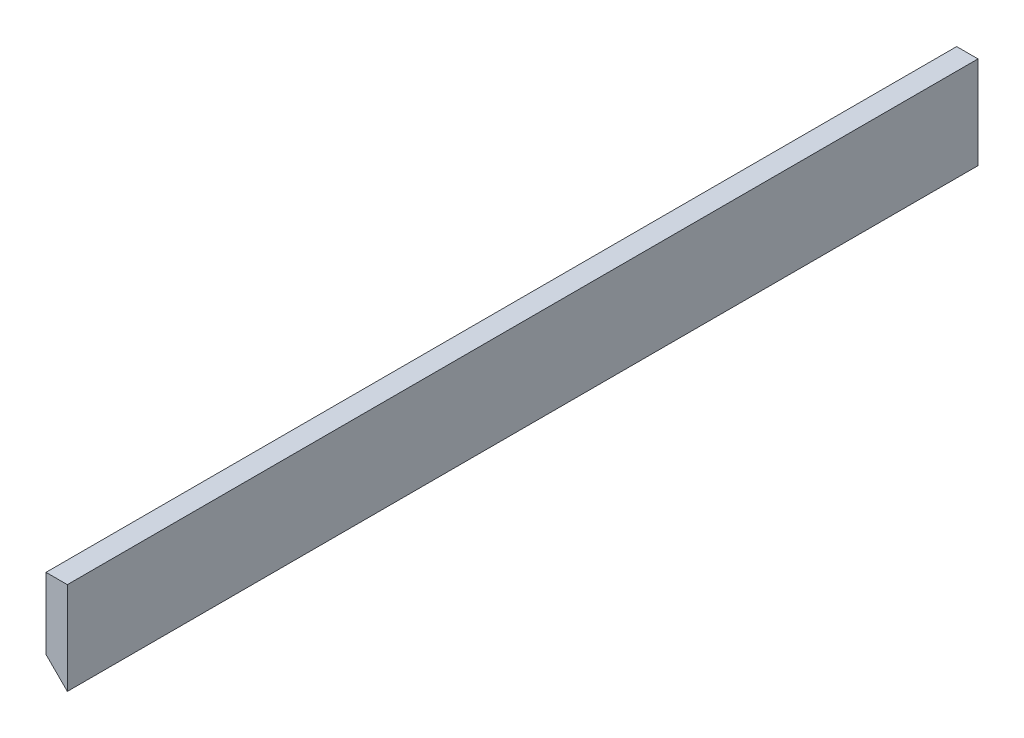
ISO-10303-21;
HEADER;
FILE_DESCRIPTION(('STEP AP214'),'2;1');
FILE_NAME('part.step','',(''),(''),'','','');
FILE_SCHEMA(('AUTOMOTIVE_DESIGN { 1 0 10303 214 1 1 1 1 }'));
ENDSEC;
DATA;
#1=APPLICATION_CONTEXT('core data for automotive mechanical design processes');
#2=APPLICATION_PROTOCOL_DEFINITION('international standard','automotive_design',2000,#1);
#3=PRODUCT_CONTEXT('',#1,'mechanical');
#4=PRODUCT('Part','Part','',(#3));
#5=PRODUCT_RELATED_PRODUCT_CATEGORY('part','',(#4));
#6=PRODUCT_DEFINITION_FORMATION('','',#4);
#7=PRODUCT_DEFINITION_CONTEXT('part definition',#1,'design');
#8=PRODUCT_DEFINITION('design','',#6,#7);
#9=PRODUCT_DEFINITION_SHAPE('','',#8);
#10=(LENGTH_UNIT() NAMED_UNIT(*) SI_UNIT(.MILLI.,.METRE.));
#11=(NAMED_UNIT(*) PLANE_ANGLE_UNIT() SI_UNIT($,.RADIAN.));
#12=(NAMED_UNIT(*) SI_UNIT($,.STERADIAN.) SOLID_ANGLE_UNIT());
#13=UNCERTAINTY_MEASURE_WITH_UNIT(LENGTH_MEASURE(1.E-05),#10,'distance_accuracy_value','');
#14=(GEOMETRIC_REPRESENTATION_CONTEXT(3) GLOBAL_UNCERTAINTY_ASSIGNED_CONTEXT((#13)) GLOBAL_UNIT_ASSIGNED_CONTEXT((#10,
#11,#12)) REPRESENTATION_CONTEXT('',''));
#15=CARTESIAN_POINT('',(0.,0.,0.));
#16=DIRECTION('',(0.,0.,1.));
#17=DIRECTION('',(1.,0.,0.));
#18=AXIS2_PLACEMENT_3D('',#15,#16,#17);
#19=CARTESIAN_POINT('',(-15.,15.0000000000001,640.));
#20=DIRECTION('',(0.707106781186551,0.707106781186544,0.));
#21=DIRECTION('',(-0.707106781186544,0.707106781186551,0.));
#22=AXIS2_PLACEMENT_3D('',#19,#20,#21);
#23=PLANE('',#22);
#24=DIRECTION('',(0.707106781186544,-0.707106781186551,0.));
#25=VECTOR('',#24,1.);
#26=CARTESIAN_POINT('',(-15.,15.0000000000001,0.));
#27=LINE('',#26,#25);
#28=CARTESIAN_POINT('',(-15.,15.0000000000001,0.));
#29=VERTEX_POINT('',#28);
#30=CARTESIAN_POINT('',(0.,0.,0.));
#31=VERTEX_POINT('',#30);
#32=EDGE_CURVE('E96',#29,#31,#27,.T.);
#33=ORIENTED_EDGE('',*,*,#32,.T.);
#34=DIRECTION('',(0.,0.,-1.));
#35=VECTOR('',#34,1.);
#36=CARTESIAN_POINT('',(0.,0.,640.));
#37=LINE('',#36,#35);
#38=CARTESIAN_POINT('',(0.,0.,640.));
#39=VERTEX_POINT('',#38);
#40=EDGE_CURVE('E11',#39,#31,#37,.T.);
#41=ORIENTED_EDGE('',*,*,#40,.F.);
#42=DIRECTION('',(0.707106781186544,-0.707106781186551,0.));
#43=VECTOR('',#42,1.);
#44=CARTESIAN_POINT('',(-15.,15.0000000000001,640.));
#45=LINE('',#44,#43);
#46=CARTESIAN_POINT('',(-15.,15.0000000000001,640.));
#47=VERTEX_POINT('',#46);
#48=EDGE_CURVE('E84',#47,#39,#45,.T.);
#49=ORIENTED_EDGE('',*,*,#48,.F.);
#50=DIRECTION('',(0.,0.,-1.));
#51=VECTOR('',#50,1.);
#52=CARTESIAN_POINT('',(-15.,15.0000000000001,640.));
#53=LINE('',#52,#51);
#54=EDGE_CURVE('E92',#47,#29,#53,.T.);
#55=ORIENTED_EDGE('',*,*,#54,.T.);
#56=EDGE_LOOP('',(#33,#41,#49,#55));
#57=FACE_BOUND('',#56,.T.);
#58=ADVANCED_FACE('F33',(#57),#23,.F.);
#59=CARTESIAN_POINT('',(0.,0.,640.));
#60=DIRECTION('',(-1.,0.,0.));
#61=DIRECTION('',(0.,0.,1.));
#62=AXIS2_PLACEMENT_3D('',#59,#60,#61);
#63=PLANE('',#62);
#64=DIRECTION('',(0.,1.,0.));
#65=VECTOR('',#64,1.);
#66=CARTESIAN_POINT('',(0.,0.,0.));
#67=LINE('',#66,#65);
#68=CARTESIAN_POINT('',(0.,65.0000000000002,0.));
#69=VERTEX_POINT('',#68);
#70=EDGE_CURVE('E88',#31,#69,#67,.T.);
#71=ORIENTED_EDGE('',*,*,#70,.T.);
#72=DIRECTION('',(0.,0.,-1.));
#73=VECTOR('',#72,1.);
#74=CARTESIAN_POINT('',(0.,65.0000000000002,640.));
#75=LINE('',#74,#73);
#76=CARTESIAN_POINT('',(0.,65.0000000000002,640.));
#77=VERTEX_POINT('',#76);
#78=EDGE_CURVE('E41',#77,#69,#75,.T.);
#79=ORIENTED_EDGE('',*,*,#78,.F.);
#80=DIRECTION('',(0.,1.,0.));
#81=VECTOR('',#80,1.);
#82=CARTESIAN_POINT('',(0.,0.,640.));
#83=LINE('',#82,#81);
#84=EDGE_CURVE('E79',#39,#77,#83,.T.);
#85=ORIENTED_EDGE('',*,*,#84,.F.);
#86=ORIENTED_EDGE('',*,*,#40,.T.);
#87=EDGE_LOOP('',(#71,#79,#85,#86));
#88=FACE_BOUND('',#87,.T.);
#89=ADVANCED_FACE('F87',(#88),#63,.F.);
#90=CARTESIAN_POINT('',(0.,65.0000000000002,640.));
#91=DIRECTION('',(0.,-1.,0.));
#92=DIRECTION('',(0.,0.,-1.));
#93=AXIS2_PLACEMENT_3D('',#90,#91,#92);
#94=PLANE('',#93);
#95=DIRECTION('',(-1.,0.,0.));
#96=VECTOR('',#95,1.);
#97=CARTESIAN_POINT('',(0.,65.0000000000002,0.));
#98=LINE('',#97,#96);
#99=CARTESIAN_POINT('',(-15.,65.0000000000002,0.));
#100=VERTEX_POINT('',#99);
#101=EDGE_CURVE('E66',#69,#100,#98,.T.);
#102=ORIENTED_EDGE('',*,*,#101,.T.);
#103=DIRECTION('',(0.,0.,-1.));
#104=VECTOR('',#103,1.);
#105=CARTESIAN_POINT('',(-15.,65.0000000000002,640.));
#106=LINE('',#105,#104);
#107=CARTESIAN_POINT('',(-15.,65.0000000000002,640.));
#108=VERTEX_POINT('',#107);
#109=EDGE_CURVE('E89',#108,#100,#106,.T.);
#110=ORIENTED_EDGE('',*,*,#109,.F.);
#111=DIRECTION('',(-1.,0.,0.));
#112=VECTOR('',#111,1.);
#113=CARTESIAN_POINT('',(0.,65.0000000000002,640.));
#114=LINE('',#113,#112);
#115=EDGE_CURVE('E82',#77,#108,#114,.T.);
#116=ORIENTED_EDGE('',*,*,#115,.F.);
#117=ORIENTED_EDGE('',*,*,#78,.T.);
#118=EDGE_LOOP('',(#102,#110,#116,#117));
#119=FACE_BOUND('',#118,.T.);
#120=ADVANCED_FACE('F90',(#119),#94,.F.);
#121=CARTESIAN_POINT('',(-15.,65.0000000000002,640.));
#122=DIRECTION('',(1.,0.,0.));
#123=DIRECTION('',(0.,1.,0.));
#124=AXIS2_PLACEMENT_3D('',#121,#122,#123);
#125=PLANE('',#124);
#126=DIRECTION('',(0.,-1.,0.));
#127=VECTOR('',#126,1.);
#128=CARTESIAN_POINT('',(-15.,65.0000000000002,0.));
#129=LINE('',#128,#127);
#130=EDGE_CURVE('E72',#100,#29,#129,.T.);
#131=ORIENTED_EDGE('',*,*,#130,.T.);
#132=ORIENTED_EDGE('',*,*,#54,.F.);
#133=DIRECTION('',(0.,-1.,0.));
#134=VECTOR('',#133,1.);
#135=CARTESIAN_POINT('',(-15.,65.0000000000002,640.));
#136=LINE('',#135,#134);
#137=EDGE_CURVE('E49',#108,#47,#136,.T.);
#138=ORIENTED_EDGE('',*,*,#137,.F.);
#139=ORIENTED_EDGE('',*,*,#109,.T.);
#140=EDGE_LOOP('',(#131,#132,#138,#139));
#141=FACE_BOUND('',#140,.T.);
#142=ADVANCED_FACE('F103',(#141),#125,.F.);
#143=CARTESIAN_POINT('',(0.,0.,640.));
#144=DIRECTION('',(0.,0.,1.));
#145=DIRECTION('',(1.,0.,0.));
#146=AXIS2_PLACEMENT_3D('',#143,#144,#145);
#147=PLANE('',#146);
#148=ORIENTED_EDGE('',*,*,#48,.T.);
#149=ORIENTED_EDGE('',*,*,#84,.T.);
#150=ORIENTED_EDGE('',*,*,#115,.T.);
#151=ORIENTED_EDGE('',*,*,#137,.T.);
#152=EDGE_LOOP('',(#148,#149,#150,#151));
#153=FACE_BOUND('',#152,.T.);
#154=ADVANCED_FACE('F80',(#153),#147,.T.);
#155=CARTESIAN_POINT('',(0.,0.,0.));
#156=DIRECTION('',(0.,0.,1.));
#157=DIRECTION('',(1.,0.,0.));
#158=AXIS2_PLACEMENT_3D('',#155,#156,#157);
#159=PLANE('',#158);
#160=ORIENTED_EDGE('',*,*,#32,.F.);
#161=ORIENTED_EDGE('',*,*,#130,.F.);
#162=ORIENTED_EDGE('',*,*,#101,.F.);
#163=ORIENTED_EDGE('',*,*,#70,.F.);
#164=EDGE_LOOP('',(#160,#161,#162,#163));
#165=FACE_BOUND('',#164,.T.);
#166=ADVANCED_FACE('F106',(#165),#159,.F.);
#167=CLOSED_SHELL('',(#58,#89,#120,#142,#154,#166));
#168=MANIFOLD_SOLID_BREP('B2',#167);
#169=ADVANCED_BREP_SHAPE_REPRESENTATION('',(#18,#168),#14);
#170=SHAPE_DEFINITION_REPRESENTATION(#9,#169);
ENDSEC;
END-ISO-10303-21;
